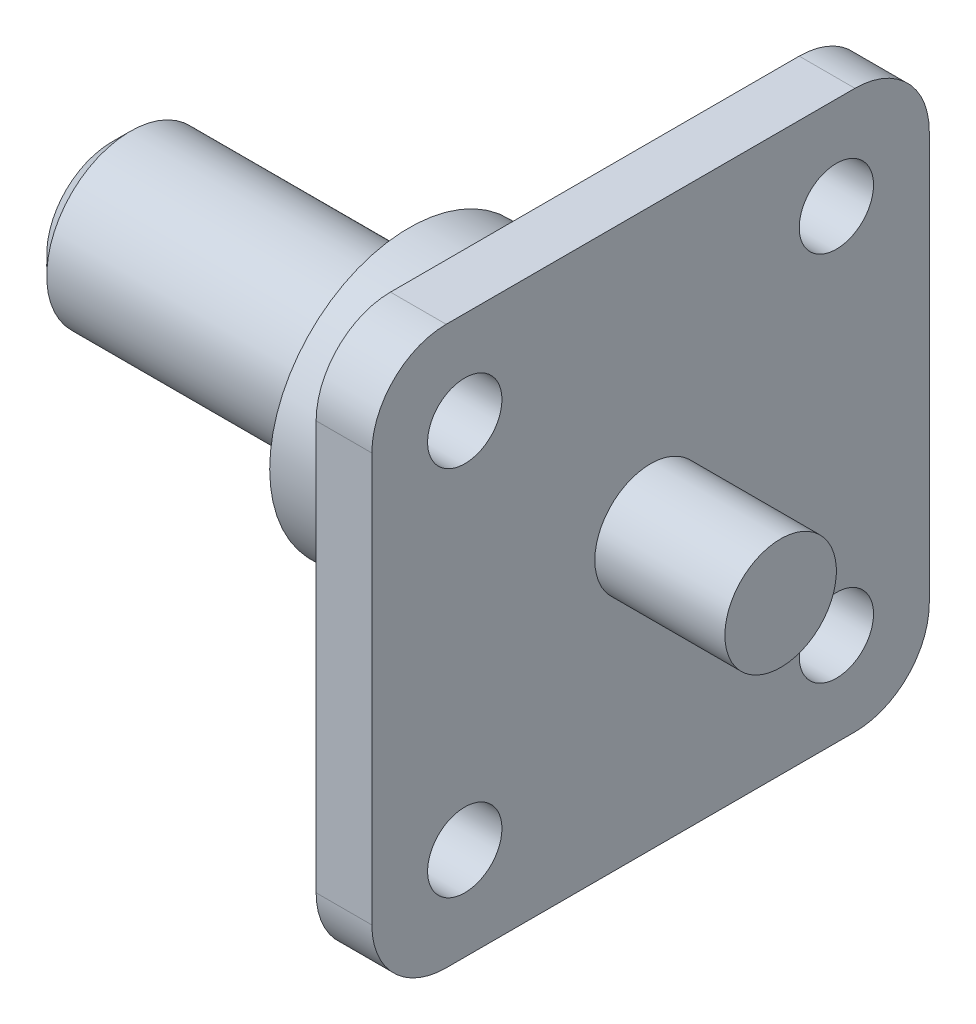
ISO-10303-21;
HEADER;
FILE_DESCRIPTION(('STEP AP214'),'2;1');
FILE_NAME('part.step','',(''),(''),'','','');
FILE_SCHEMA(('AUTOMOTIVE_DESIGN { 1 0 10303 214 1 1 1 1 }'));
ENDSEC;
DATA;
#1=APPLICATION_CONTEXT('core data for automotive mechanical design processes');
#2=APPLICATION_PROTOCOL_DEFINITION('international standard','automotive_design',2000,#1);
#3=PRODUCT_CONTEXT('',#1,'mechanical');
#4=PRODUCT('Part','Part','',(#3));
#5=PRODUCT_RELATED_PRODUCT_CATEGORY('part','',(#4));
#6=PRODUCT_DEFINITION_FORMATION('','',#4);
#7=PRODUCT_DEFINITION_CONTEXT('part definition',#1,'design');
#8=PRODUCT_DEFINITION('design','',#6,#7);
#9=PRODUCT_DEFINITION_SHAPE('','',#8);
#10=(LENGTH_UNIT() NAMED_UNIT(*) SI_UNIT(.MILLI.,.METRE.));
#11=(NAMED_UNIT(*) PLANE_ANGLE_UNIT() SI_UNIT($,.RADIAN.));
#12=(NAMED_UNIT(*) SI_UNIT($,.STERADIAN.) SOLID_ANGLE_UNIT());
#13=UNCERTAINTY_MEASURE_WITH_UNIT(LENGTH_MEASURE(1.E-05),#10,'distance_accuracy_value','');
#14=(GEOMETRIC_REPRESENTATION_CONTEXT(3) GLOBAL_UNCERTAINTY_ASSIGNED_CONTEXT((#13)) GLOBAL_UNIT_ASSIGNED_CONTEXT((#10,
#11,#12)) REPRESENTATION_CONTEXT('',''));
#15=CARTESIAN_POINT('',(0.,0.,0.));
#16=DIRECTION('',(0.,0.,1.));
#17=DIRECTION('',(1.,0.,0.));
#18=AXIS2_PLACEMENT_3D('',#15,#16,#17);
#19=CARTESIAN_POINT('',(-16.,0.,0.));
#20=DIRECTION('',(1.,0.,0.));
#21=DIRECTION('',(0.,0.,-1.));
#22=AXIS2_PLACEMENT_3D('',#19,#20,#21);
#23=PLANE('',#22);
#24=CARTESIAN_POINT('',(-16.,0.,0.));
#25=DIRECTION('',(1.,0.,0.));
#26=DIRECTION('',(0.,0.,-1.));
#27=AXIS2_PLACEMENT_3D('',#24,#25,#26);
#28=CIRCLE('',#27,3.5);
#29=CARTESIAN_POINT('',(-16.,0.,-3.5));
#30=VERTEX_POINT('',#29);
#31=EDGE_CURVE('E176',#30,#30,#28,.F.);
#32=ORIENTED_EDGE('',*,*,#31,.T.);
#33=EDGE_LOOP('',(#32));
#34=FACE_BOUND('',#33,.T.);
#35=ADVANCED_FACE('F32',(#34),#23,.F.);
#36=CARTESIAN_POINT('',(-18.3711340206185,0.,0.));
#37=DIRECTION('',(-1.,0.,0.));
#38=DIRECTION('',(0.,0.,1.));
#39=AXIS2_PLACEMENT_3D('',#36,#37,#38);
#40=CYLINDRICAL_SURFACE('',#39,4.5);
#41=CARTESIAN_POINT('',(-15.,0.,0.));
#42=DIRECTION('',(1.,0.,0.));
#43=DIRECTION('',(0.,0.,-1.));
#44=AXIS2_PLACEMENT_3D('',#41,#42,#43);
#45=CIRCLE('',#44,4.5);
#46=CARTESIAN_POINT('',(-15.,0.,-4.5));
#47=VERTEX_POINT('',#46);
#48=EDGE_CURVE('E41',#47,#47,#45,.T.);
#49=ORIENTED_EDGE('',*,*,#48,.T.);
#50=EDGE_LOOP('',(#49));
#51=FACE_BOUND('',#50,.T.);
#52=CARTESIAN_POINT('',(-1.,0.,0.));
#53=DIRECTION('',(1.,0.,0.));
#54=DIRECTION('',(0.,0.,-1.));
#55=AXIS2_PLACEMENT_3D('',#52,#53,#54);
#56=CIRCLE('',#55,4.5);
#57=CARTESIAN_POINT('',(-1.,0.,-4.5));
#58=VERTEX_POINT('',#57);
#59=EDGE_CURVE('E170',#58,#58,#56,.F.);
#60=ORIENTED_EDGE('',*,*,#59,.T.);
#61=EDGE_LOOP('',(#60));
#62=FACE_BOUND('',#61,.T.);
#63=ADVANCED_FACE('F181',(#51,#62),#40,.T.);
#64=CARTESIAN_POINT('',(0.,4.5,0.));
#65=DIRECTION('',(1.,0.,0.));
#66=DIRECTION('',(0.,0.,-1.));
#67=AXIS2_PLACEMENT_3D('',#64,#65,#66);
#68=PLANE('',#67);
#69=CARTESIAN_POINT('',(0.,0.,0.));
#70=DIRECTION('',(1.,0.,0.));
#71=DIRECTION('',(0.,0.,-1.));
#72=AXIS2_PLACEMENT_3D('',#69,#70,#71);
#73=CIRCLE('',#72,5.5);
#74=CARTESIAN_POINT('',(0.,0.,-5.5));
#75=VERTEX_POINT('',#74);
#76=EDGE_CURVE('E173',#75,#75,#73,.T.);
#77=ORIENTED_EDGE('',*,*,#76,.T.);
#78=EDGE_LOOP('',(#77));
#79=FACE_BOUND('',#78,.T.);
#80=CARTESIAN_POINT('',(0.,0.,0.));
#81=DIRECTION('',(-1.,0.,0.));
#82=DIRECTION('',(0.,0.,1.));
#83=AXIS2_PLACEMENT_3D('',#80,#81,#82);
#84=CIRCLE('',#83,7.5);
#85=CARTESIAN_POINT('',(0.,0.,7.5));
#86=VERTEX_POINT('',#85);
#87=EDGE_CURVE('E167',#86,#86,#84,.T.);
#88=ORIENTED_EDGE('',*,*,#87,.T.);
#89=EDGE_LOOP('',(#88));
#90=FACE_BOUND('',#89,.T.);
#91=ADVANCED_FACE('F194',(#79,#90),#68,.F.);
#92=CARTESIAN_POINT('',(-18.3711340206185,0.,0.));
#93=DIRECTION('',(-1.,0.,0.));
#94=DIRECTION('',(0.,0.,1.));
#95=AXIS2_PLACEMENT_3D('',#92,#93,#94);
#96=CYLINDRICAL_SURFACE('',#95,7.5);
#97=ORIENTED_EDGE('',*,*,#87,.F.);
#98=EDGE_LOOP('',(#97));
#99=FACE_BOUND('',#98,.T.);
#100=CARTESIAN_POINT('',(10.,0.,0.));
#101=DIRECTION('',(-1.,0.,0.));
#102=DIRECTION('',(0.,0.,1.));
#103=AXIS2_PLACEMENT_3D('',#100,#101,#102);
#104=CIRCLE('',#103,7.5);
#105=CARTESIAN_POINT('',(10.,0.,7.5));
#106=VERTEX_POINT('',#105);
#107=EDGE_CURVE('E161',#106,#106,#104,.T.);
#108=ORIENTED_EDGE('',*,*,#107,.T.);
#109=EDGE_LOOP('',(#108));
#110=FACE_BOUND('',#109,.T.);
#111=ADVANCED_FACE('F198',(#99,#110),#96,.T.);
#112=CARTESIAN_POINT('',(-1.,0.,0.));
#113=DIRECTION('',(1.,0.,0.));
#114=DIRECTION('',(0.,0.,-1.));
#115=AXIS2_PLACEMENT_3D('',#112,#113,#114);
#116=TOROIDAL_SURFACE('',#115,5.5,1.);
#117=ORIENTED_EDGE('',*,*,#76,.F.);
#118=EDGE_LOOP('',(#117));
#119=FACE_BOUND('',#118,.T.);
#120=ORIENTED_EDGE('',*,*,#59,.F.);
#121=EDGE_LOOP('',(#120));
#122=FACE_BOUND('',#121,.T.);
#123=ADVANCED_FACE('F186',(#119,#122),#116,.F.);
#124=CARTESIAN_POINT('',(-16.,0.,0.));
#125=DIRECTION('',(1.,0.,0.));
#126=DIRECTION('',(0.,0.,-1.));
#127=AXIS2_PLACEMENT_3D('',#124,#125,#126);
#128=CONICAL_SURFACE('',#127,3.5,0.785398163397446);
#129=ORIENTED_EDGE('',*,*,#48,.F.);
#130=EDGE_LOOP('',(#129));
#131=FACE_BOUND('',#130,.T.);
#132=ORIENTED_EDGE('',*,*,#31,.F.);
#133=EDGE_LOOP('',(#132));
#134=FACE_BOUND('',#133,.T.);
#135=ADVANCED_FACE('F34',(#131,#134),#128,.T.);
#136=CARTESIAN_POINT('',(13.,-11.,11.));
#137=DIRECTION('',(-1.,0.,0.));
#138=DIRECTION('',(0.,0.,1.));
#139=AXIS2_PLACEMENT_3D('',#136,#137,#138);
#140=PLANE('',#139);
#141=CARTESIAN_POINT('',(13.,0.,0.));
#142=DIRECTION('',(-1.,0.,0.));
#143=DIRECTION('',(0.,0.,1.));
#144=AXIS2_PLACEMENT_3D('',#141,#142,#143);
#145=CIRCLE('',#144,3.);
#146=CARTESIAN_POINT('',(13.,0.,3.));
#147=VERTEX_POINT('',#146);
#148=EDGE_CURVE('E11',#147,#147,#145,.T.);
#149=ORIENTED_EDGE('',*,*,#148,.T.);
#150=EDGE_LOOP('',(#149));
#151=FACE_BOUND('',#150,.T.);
#152=CARTESIAN_POINT('',(13.,-11.,11.));
#153=DIRECTION('',(1.,0.,0.));
#154=DIRECTION('',(0.,0.,1.));
#155=AXIS2_PLACEMENT_3D('',#152,#153,#154);
#156=CIRCLE('',#155,4.);
#157=CARTESIAN_POINT('',(13.,-11.,15.));
#158=VERTEX_POINT('',#157);
#159=CARTESIAN_POINT('',(13.,-15.,11.));
#160=VERTEX_POINT('',#159);
#161=EDGE_CURVE('E146',#158,#160,#156,.T.);
#162=ORIENTED_EDGE('',*,*,#161,.T.);
#163=DIRECTION('',(0.,0.,-1.));
#164=VECTOR('',#163,1.);
#165=CARTESIAN_POINT('',(13.,-15.,11.));
#166=LINE('',#165,#164);
#167=CARTESIAN_POINT('',(13.,-15.,-11.));
#168=VERTEX_POINT('',#167);
#169=EDGE_CURVE('E93',#160,#168,#166,.T.);
#170=ORIENTED_EDGE('',*,*,#169,.T.);
#171=CARTESIAN_POINT('',(13.,-11.,-11.));
#172=DIRECTION('',(1.,0.,0.));
#173=DIRECTION('',(0.,0.,-1.));
#174=AXIS2_PLACEMENT_3D('',#171,#172,#173);
#175=CIRCLE('',#174,4.);
#176=CARTESIAN_POINT('',(13.,-11.,-15.));
#177=VERTEX_POINT('',#176);
#178=EDGE_CURVE('E256',#168,#177,#175,.T.);
#179=ORIENTED_EDGE('',*,*,#178,.T.);
#180=DIRECTION('',(0.,1.,0.));
#181=VECTOR('',#180,1.);
#182=CARTESIAN_POINT('',(13.,-11.,-15.));
#183=LINE('',#182,#181);
#184=CARTESIAN_POINT('',(13.,11.,-15.));
#185=VERTEX_POINT('',#184);
#186=EDGE_CURVE('E258',#177,#185,#183,.T.);
#187=ORIENTED_EDGE('',*,*,#186,.T.);
#188=CARTESIAN_POINT('',(13.,11.,-11.));
#189=DIRECTION('',(1.,0.,0.));
#190=DIRECTION('',(0.,0.,1.));
#191=AXIS2_PLACEMENT_3D('',#188,#189,#190);
#192=CIRCLE('',#191,4.);
#193=CARTESIAN_POINT('',(13.,15.,-11.));
#194=VERTEX_POINT('',#193);
#195=EDGE_CURVE('E113',#185,#194,#192,.T.);
#196=ORIENTED_EDGE('',*,*,#195,.T.);
#197=DIRECTION('',(0.,0.,1.));
#198=VECTOR('',#197,1.);
#199=CARTESIAN_POINT('',(13.,15.,11.));
#200=LINE('',#199,#198);
#201=CARTESIAN_POINT('',(13.,15.,11.));
#202=VERTEX_POINT('',#201);
#203=EDGE_CURVE('E106',#194,#202,#200,.T.);
#204=ORIENTED_EDGE('',*,*,#203,.T.);
#205=CARTESIAN_POINT('',(13.,11.,11.));
#206=DIRECTION('',(1.,0.,0.));
#207=DIRECTION('',(0.,0.,1.));
#208=AXIS2_PLACEMENT_3D('',#205,#206,#207);
#209=CIRCLE('',#208,4.);
#210=CARTESIAN_POINT('',(13.,11.,15.));
#211=VERTEX_POINT('',#210);
#212=EDGE_CURVE('E111',#202,#211,#209,.T.);
#213=ORIENTED_EDGE('',*,*,#212,.T.);
#214=DIRECTION('',(0.,-1.,0.));
#215=VECTOR('',#214,1.);
#216=CARTESIAN_POINT('',(13.,-11.,15.));
#217=LINE('',#216,#215);
#218=EDGE_CURVE('E49',#211,#158,#217,.T.);
#219=ORIENTED_EDGE('',*,*,#218,.T.);
#220=EDGE_LOOP('',(#162,#170,#179,#187,#196,#204,#213,#219));
#221=FACE_BOUND('',#220,.T.);
#222=CARTESIAN_POINT('',(13.,10.,10.));
#223=DIRECTION('',(1.,0.,0.));
#224=DIRECTION('',(0.,0.,-1.));
#225=AXIS2_PLACEMENT_3D('',#222,#223,#224);
#226=CIRCLE('',#225,2.);
#227=CARTESIAN_POINT('',(13.,10.,8.));
#228=VERTEX_POINT('',#227);
#229=EDGE_CURVE('E135',#228,#228,#226,.T.);
#230=ORIENTED_EDGE('',*,*,#229,.F.);
#231=EDGE_LOOP('',(#230));
#232=FACE_BOUND('',#231,.T.);
#233=CARTESIAN_POINT('',(13.,10.,-10.));
#234=DIRECTION('',(1.,0.,0.));
#235=DIRECTION('',(0.,0.,-1.));
#236=AXIS2_PLACEMENT_3D('',#233,#234,#235);
#237=CIRCLE('',#236,2.);
#238=CARTESIAN_POINT('',(13.,10.,-12.));
#239=VERTEX_POINT('',#238);
#240=EDGE_CURVE('E247',#239,#239,#237,.T.);
#241=ORIENTED_EDGE('',*,*,#240,.F.);
#242=EDGE_LOOP('',(#241));
#243=FACE_BOUND('',#242,.T.);
#244=CARTESIAN_POINT('',(13.,-10.,-10.));
#245=DIRECTION('',(1.,0.,0.));
#246=DIRECTION('',(0.,0.,-1.));
#247=AXIS2_PLACEMENT_3D('',#244,#245,#246);
#248=CIRCLE('',#247,2.);
#249=CARTESIAN_POINT('',(13.,-10.,-12.));
#250=VERTEX_POINT('',#249);
#251=EDGE_CURVE('E243',#250,#250,#248,.T.);
#252=ORIENTED_EDGE('',*,*,#251,.F.);
#253=EDGE_LOOP('',(#252));
#254=FACE_BOUND('',#253,.T.);
#255=CARTESIAN_POINT('',(13.,-10.,10.));
#256=DIRECTION('',(1.,0.,0.));
#257=DIRECTION('',(0.,0.,-1.));
#258=AXIS2_PLACEMENT_3D('',#255,#256,#257);
#259=CIRCLE('',#258,2.);
#260=CARTESIAN_POINT('',(13.,-10.,8.));
#261=VERTEX_POINT('',#260);
#262=EDGE_CURVE('E238',#261,#261,#259,.T.);
#263=ORIENTED_EDGE('',*,*,#262,.F.);
#264=EDGE_LOOP('',(#263));
#265=FACE_BOUND('',#264,.T.);
#266=ADVANCED_FACE('F108',(#151,#221,#232,#243,#254,#265),#140,.F.);
#267=CARTESIAN_POINT('',(10.,-11.,11.));
#268=DIRECTION('',(-1.,0.,0.));
#269=DIRECTION('',(0.,0.,1.));
#270=AXIS2_PLACEMENT_3D('',#267,#268,#269);
#271=PLANE('',#270);
#272=ORIENTED_EDGE('',*,*,#107,.F.);
#273=EDGE_LOOP('',(#272));
#274=FACE_BOUND('',#273,.T.);
#275=CARTESIAN_POINT('',(10.,-10.,-10.));
#276=DIRECTION('',(1.,0.,0.));
#277=DIRECTION('',(0.,0.,-1.));
#278=AXIS2_PLACEMENT_3D('',#275,#276,#277);
#279=CIRCLE('',#278,2.);
#280=CARTESIAN_POINT('',(10.,-10.,-12.));
#281=VERTEX_POINT('',#280);
#282=EDGE_CURVE('E223',#281,#281,#279,.T.);
#283=ORIENTED_EDGE('',*,*,#282,.T.);
#284=EDGE_LOOP('',(#283));
#285=FACE_BOUND('',#284,.T.);
#286=CARTESIAN_POINT('',(10.,10.,10.));
#287=DIRECTION('',(1.,0.,0.));
#288=DIRECTION('',(0.,0.,-1.));
#289=AXIS2_PLACEMENT_3D('',#286,#287,#288);
#290=CIRCLE('',#289,2.);
#291=CARTESIAN_POINT('',(10.,10.,8.));
#292=VERTEX_POINT('',#291);
#293=EDGE_CURVE('E227',#292,#292,#290,.T.);
#294=ORIENTED_EDGE('',*,*,#293,.T.);
#295=EDGE_LOOP('',(#294));
#296=FACE_BOUND('',#295,.T.);
#297=CARTESIAN_POINT('',(10.,-11.,11.));
#298=DIRECTION('',(1.,0.,0.));
#299=DIRECTION('',(0.,0.,1.));
#300=AXIS2_PLACEMENT_3D('',#297,#298,#299);
#301=CIRCLE('',#300,4.);
#302=CARTESIAN_POINT('',(10.,-11.,15.));
#303=VERTEX_POINT('',#302);
#304=CARTESIAN_POINT('',(10.,-15.,11.));
#305=VERTEX_POINT('',#304);
#306=EDGE_CURVE('E131',#303,#305,#301,.T.);
#307=ORIENTED_EDGE('',*,*,#306,.F.);
#308=DIRECTION('',(0.,-1.,0.));
#309=VECTOR('',#308,1.);
#310=CARTESIAN_POINT('',(10.,-11.,15.));
#311=LINE('',#310,#309);
#312=CARTESIAN_POINT('',(10.,11.,15.));
#313=VERTEX_POINT('',#312);
#314=EDGE_CURVE('E84',#313,#303,#311,.T.);
#315=ORIENTED_EDGE('',*,*,#314,.F.);
#316=CARTESIAN_POINT('',(10.,11.,11.));
#317=DIRECTION('',(1.,0.,0.));
#318=DIRECTION('',(0.,0.,1.));
#319=AXIS2_PLACEMENT_3D('',#316,#317,#318);
#320=CIRCLE('',#319,4.);
#321=CARTESIAN_POINT('',(10.,15.,11.));
#322=VERTEX_POINT('',#321);
#323=EDGE_CURVE('E78',#322,#313,#320,.T.);
#324=ORIENTED_EDGE('',*,*,#323,.F.);
#325=DIRECTION('',(0.,0.,1.));
#326=VECTOR('',#325,1.);
#327=CARTESIAN_POINT('',(10.,15.,11.));
#328=LINE('',#327,#326);
#329=CARTESIAN_POINT('',(10.,15.,-11.));
#330=VERTEX_POINT('',#329);
#331=EDGE_CURVE('E121',#330,#322,#328,.T.);
#332=ORIENTED_EDGE('',*,*,#331,.F.);
#333=CARTESIAN_POINT('',(10.,11.,-11.));
#334=DIRECTION('',(1.,0.,0.));
#335=DIRECTION('',(0.,0.,1.));
#336=AXIS2_PLACEMENT_3D('',#333,#334,#335);
#337=CIRCLE('',#336,4.);
#338=CARTESIAN_POINT('',(10.,11.,-15.));
#339=VERTEX_POINT('',#338);
#340=EDGE_CURVE('E141',#339,#330,#337,.T.);
#341=ORIENTED_EDGE('',*,*,#340,.F.);
#342=DIRECTION('',(0.,1.,0.));
#343=VECTOR('',#342,1.);
#344=CARTESIAN_POINT('',(10.,-11.,-15.));
#345=LINE('',#344,#343);
#346=CARTESIAN_POINT('',(10.,-11.,-15.));
#347=VERTEX_POINT('',#346);
#348=EDGE_CURVE('E139',#347,#339,#345,.T.);
#349=ORIENTED_EDGE('',*,*,#348,.F.);
#350=CARTESIAN_POINT('',(10.,-11.,-11.));
#351=DIRECTION('',(1.,0.,0.));
#352=DIRECTION('',(0.,0.,-1.));
#353=AXIS2_PLACEMENT_3D('',#350,#351,#352);
#354=CIRCLE('',#353,4.);
#355=CARTESIAN_POINT('',(10.,-15.,-11.));
#356=VERTEX_POINT('',#355);
#357=EDGE_CURVE('E137',#356,#347,#354,.T.);
#358=ORIENTED_EDGE('',*,*,#357,.F.);
#359=DIRECTION('',(0.,0.,-1.));
#360=VECTOR('',#359,1.);
#361=CARTESIAN_POINT('',(10.,-15.,11.));
#362=LINE('',#361,#360);
#363=EDGE_CURVE('E134',#305,#356,#362,.T.);
#364=ORIENTED_EDGE('',*,*,#363,.F.);
#365=EDGE_LOOP('',(#307,#315,#324,#332,#341,#349,#358,#364));
#366=FACE_BOUND('',#365,.T.);
#367=CARTESIAN_POINT('',(10.,10.,-10.));
#368=DIRECTION('',(1.,0.,0.));
#369=DIRECTION('',(0.,0.,-1.));
#370=AXIS2_PLACEMENT_3D('',#367,#368,#369);
#371=CIRCLE('',#370,2.);
#372=CARTESIAN_POINT('',(10.,10.,-12.));
#373=VERTEX_POINT('',#372);
#374=EDGE_CURVE('E233',#373,#373,#371,.T.);
#375=ORIENTED_EDGE('',*,*,#374,.T.);
#376=EDGE_LOOP('',(#375));
#377=FACE_BOUND('',#376,.T.);
#378=CARTESIAN_POINT('',(10.,-10.,10.));
#379=DIRECTION('',(1.,0.,0.));
#380=DIRECTION('',(0.,0.,-1.));
#381=AXIS2_PLACEMENT_3D('',#378,#379,#380);
#382=CIRCLE('',#381,2.);
#383=CARTESIAN_POINT('',(10.,-10.,8.));
#384=VERTEX_POINT('',#383);
#385=EDGE_CURVE('E236',#384,#384,#382,.T.);
#386=ORIENTED_EDGE('',*,*,#385,.T.);
#387=EDGE_LOOP('',(#386));
#388=FACE_BOUND('',#387,.T.);
#389=ADVANCED_FACE('F215',(#274,#285,#296,#366,#377,#388),#271,.T.);
#390=CARTESIAN_POINT('',(13.,-11.,11.));
#391=DIRECTION('',(-1.,0.,0.));
#392=DIRECTION('',(0.,0.,1.));
#393=AXIS2_PLACEMENT_3D('',#390,#391,#392);
#394=CYLINDRICAL_SURFACE('',#393,4.);
#395=ORIENTED_EDGE('',*,*,#306,.T.);
#396=DIRECTION('',(-1.,0.,0.));
#397=VECTOR('',#396,1.);
#398=CARTESIAN_POINT('',(13.,-15.,11.));
#399=LINE('',#398,#397);
#400=EDGE_CURVE('E159',#160,#305,#399,.T.);
#401=ORIENTED_EDGE('',*,*,#400,.F.);
#402=ORIENTED_EDGE('',*,*,#161,.F.);
#403=DIRECTION('',(-1.,0.,0.));
#404=VECTOR('',#403,1.);
#405=CARTESIAN_POINT('',(13.,-11.,15.));
#406=LINE('',#405,#404);
#407=EDGE_CURVE('E127',#158,#303,#406,.T.);
#408=ORIENTED_EDGE('',*,*,#407,.T.);
#409=EDGE_LOOP('',(#395,#401,#402,#408));
#410=FACE_BOUND('',#409,.T.);
#411=ADVANCED_FACE('F218',(#410),#394,.T.);
#412=CARTESIAN_POINT('',(13.,-15.,11.));
#413=DIRECTION('',(0.,1.,0.));
#414=DIRECTION('',(0.,0.,1.));
#415=AXIS2_PLACEMENT_3D('',#412,#413,#414);
#416=PLANE('',#415);
#417=ORIENTED_EDGE('',*,*,#363,.T.);
#418=DIRECTION('',(-1.,0.,0.));
#419=VECTOR('',#418,1.);
#420=CARTESIAN_POINT('',(13.,-15.,-11.));
#421=LINE('',#420,#419);
#422=EDGE_CURVE('E156',#168,#356,#421,.T.);
#423=ORIENTED_EDGE('',*,*,#422,.F.);
#424=ORIENTED_EDGE('',*,*,#169,.F.);
#425=ORIENTED_EDGE('',*,*,#400,.T.);
#426=EDGE_LOOP('',(#417,#423,#424,#425));
#427=FACE_BOUND('',#426,.T.);
#428=ADVANCED_FACE('F272',(#427),#416,.F.);
#429=CARTESIAN_POINT('',(13.,-11.,-11.));
#430=DIRECTION('',(-1.,0.,0.));
#431=DIRECTION('',(0.,0.,1.));
#432=AXIS2_PLACEMENT_3D('',#429,#430,#431);
#433=CYLINDRICAL_SURFACE('',#432,4.);
#434=ORIENTED_EDGE('',*,*,#357,.T.);
#435=DIRECTION('',(-1.,0.,0.));
#436=VECTOR('',#435,1.);
#437=CARTESIAN_POINT('',(13.,-11.,-15.));
#438=LINE('',#437,#436);
#439=EDGE_CURVE('E153',#177,#347,#438,.T.);
#440=ORIENTED_EDGE('',*,*,#439,.F.);
#441=ORIENTED_EDGE('',*,*,#178,.F.);
#442=ORIENTED_EDGE('',*,*,#422,.T.);
#443=EDGE_LOOP('',(#434,#440,#441,#442));
#444=FACE_BOUND('',#443,.T.);
#445=ADVANCED_FACE('F271',(#444),#433,.T.);
#446=CARTESIAN_POINT('',(13.,-11.,-15.));
#447=DIRECTION('',(0.,0.,1.));
#448=DIRECTION('',(1.,0.,0.));
#449=AXIS2_PLACEMENT_3D('',#446,#447,#448);
#450=PLANE('',#449);
#451=ORIENTED_EDGE('',*,*,#348,.T.);
#452=DIRECTION('',(-1.,0.,0.));
#453=VECTOR('',#452,1.);
#454=CARTESIAN_POINT('',(13.,11.,-15.));
#455=LINE('',#454,#453);
#456=EDGE_CURVE('E150',#185,#339,#455,.T.);
#457=ORIENTED_EDGE('',*,*,#456,.F.);
#458=ORIENTED_EDGE('',*,*,#186,.F.);
#459=ORIENTED_EDGE('',*,*,#439,.T.);
#460=EDGE_LOOP('',(#451,#457,#458,#459));
#461=FACE_BOUND('',#460,.T.);
#462=ADVANCED_FACE('F264',(#461),#450,.F.);
#463=CARTESIAN_POINT('',(13.,11.,-11.));
#464=DIRECTION('',(-1.,0.,0.));
#465=DIRECTION('',(0.,0.,1.));
#466=AXIS2_PLACEMENT_3D('',#463,#464,#465);
#467=CYLINDRICAL_SURFACE('',#466,4.);
#468=ORIENTED_EDGE('',*,*,#340,.T.);
#469=DIRECTION('',(-1.,0.,0.));
#470=VECTOR('',#469,1.);
#471=CARTESIAN_POINT('',(13.,15.,-11.));
#472=LINE('',#471,#470);
#473=EDGE_CURVE('E122',#194,#330,#472,.T.);
#474=ORIENTED_EDGE('',*,*,#473,.F.);
#475=ORIENTED_EDGE('',*,*,#195,.F.);
#476=ORIENTED_EDGE('',*,*,#456,.T.);
#477=EDGE_LOOP('',(#468,#474,#475,#476));
#478=FACE_BOUND('',#477,.T.);
#479=ADVANCED_FACE('F268',(#478),#467,.T.);
#480=CARTESIAN_POINT('',(13.,15.,11.));
#481=DIRECTION('',(0.,-1.,0.));
#482=DIRECTION('',(0.,0.,-1.));
#483=AXIS2_PLACEMENT_3D('',#480,#481,#482);
#484=PLANE('',#483);
#485=ORIENTED_EDGE('',*,*,#331,.T.);
#486=DIRECTION('',(-1.,0.,0.));
#487=VECTOR('',#486,1.);
#488=CARTESIAN_POINT('',(13.,15.,11.));
#489=LINE('',#488,#487);
#490=EDGE_CURVE('E118',#202,#322,#489,.T.);
#491=ORIENTED_EDGE('',*,*,#490,.F.);
#492=ORIENTED_EDGE('',*,*,#203,.F.);
#493=ORIENTED_EDGE('',*,*,#473,.T.);
#494=EDGE_LOOP('',(#485,#491,#492,#493));
#495=FACE_BOUND('',#494,.T.);
#496=ADVANCED_FACE('F119',(#495),#484,.F.);
#497=CARTESIAN_POINT('',(13.,11.,11.));
#498=DIRECTION('',(-1.,0.,0.));
#499=DIRECTION('',(0.,0.,1.));
#500=AXIS2_PLACEMENT_3D('',#497,#498,#499);
#501=CYLINDRICAL_SURFACE('',#500,4.);
#502=ORIENTED_EDGE('',*,*,#323,.T.);
#503=DIRECTION('',(-1.,0.,0.));
#504=VECTOR('',#503,1.);
#505=CARTESIAN_POINT('',(13.,11.,15.));
#506=LINE('',#505,#504);
#507=EDGE_CURVE('E123',#211,#313,#506,.T.);
#508=ORIENTED_EDGE('',*,*,#507,.F.);
#509=ORIENTED_EDGE('',*,*,#212,.F.);
#510=ORIENTED_EDGE('',*,*,#490,.T.);
#511=EDGE_LOOP('',(#502,#508,#509,#510));
#512=FACE_BOUND('',#511,.T.);
#513=ADVANCED_FACE('F125',(#512),#501,.T.);
#514=CARTESIAN_POINT('',(13.,-11.,15.));
#515=DIRECTION('',(0.,0.,-1.));
#516=DIRECTION('',(-1.,0.,0.));
#517=AXIS2_PLACEMENT_3D('',#514,#515,#516);
#518=PLANE('',#517);
#519=ORIENTED_EDGE('',*,*,#314,.T.);
#520=ORIENTED_EDGE('',*,*,#407,.F.);
#521=ORIENTED_EDGE('',*,*,#218,.F.);
#522=ORIENTED_EDGE('',*,*,#507,.T.);
#523=EDGE_LOOP('',(#519,#520,#521,#522));
#524=FACE_BOUND('',#523,.T.);
#525=ADVANCED_FACE('F276',(#524),#518,.F.);
#526=CARTESIAN_POINT('',(13.,10.,10.));
#527=DIRECTION('',(-1.,0.,0.));
#528=DIRECTION('',(0.,0.,1.));
#529=AXIS2_PLACEMENT_3D('',#526,#527,#528);
#530=CYLINDRICAL_SURFACE('',#529,2.);
#531=ORIENTED_EDGE('',*,*,#229,.T.);
#532=EDGE_LOOP('',(#531));
#533=FACE_BOUND('',#532,.T.);
#534=ORIENTED_EDGE('',*,*,#293,.F.);
#535=EDGE_LOOP('',(#534));
#536=FACE_BOUND('',#535,.T.);
#537=ADVANCED_FACE('F278',(#533,#536),#530,.F.);
#538=CARTESIAN_POINT('',(13.,10.,-10.));
#539=DIRECTION('',(-1.,0.,0.));
#540=DIRECTION('',(0.,0.,1.));
#541=AXIS2_PLACEMENT_3D('',#538,#539,#540);
#542=CYLINDRICAL_SURFACE('',#541,2.);
#543=ORIENTED_EDGE('',*,*,#240,.T.);
#544=EDGE_LOOP('',(#543));
#545=FACE_BOUND('',#544,.T.);
#546=ORIENTED_EDGE('',*,*,#374,.F.);
#547=EDGE_LOOP('',(#546));
#548=FACE_BOUND('',#547,.T.);
#549=ADVANCED_FACE('F284',(#545,#548),#542,.F.);
#550=CARTESIAN_POINT('',(13.,-10.,-10.));
#551=DIRECTION('',(-1.,0.,0.));
#552=DIRECTION('',(0.,0.,1.));
#553=AXIS2_PLACEMENT_3D('',#550,#551,#552);
#554=CYLINDRICAL_SURFACE('',#553,2.);
#555=ORIENTED_EDGE('',*,*,#251,.T.);
#556=EDGE_LOOP('',(#555));
#557=FACE_BOUND('',#556,.T.);
#558=ORIENTED_EDGE('',*,*,#282,.F.);
#559=EDGE_LOOP('',(#558));
#560=FACE_BOUND('',#559,.T.);
#561=ADVANCED_FACE('F322',(#557,#560),#554,.F.);
#562=CARTESIAN_POINT('',(13.,-10.,10.));
#563=DIRECTION('',(-1.,0.,0.));
#564=DIRECTION('',(0.,0.,1.));
#565=AXIS2_PLACEMENT_3D('',#562,#563,#564);
#566=CYLINDRICAL_SURFACE('',#565,2.);
#567=ORIENTED_EDGE('',*,*,#262,.T.);
#568=EDGE_LOOP('',(#567));
#569=FACE_BOUND('',#568,.T.);
#570=ORIENTED_EDGE('',*,*,#385,.F.);
#571=EDGE_LOOP('',(#570));
#572=FACE_BOUND('',#571,.T.);
#573=ADVANCED_FACE('F306',(#569,#572),#566,.F.);
#574=CARTESIAN_POINT('',(20.,3.,0.));
#575=DIRECTION('',(-1.,0.,0.));
#576=DIRECTION('',(0.,0.,1.));
#577=AXIS2_PLACEMENT_3D('',#574,#575,#576);
#578=PLANE('',#577);
#579=CARTESIAN_POINT('',(20.,0.,0.));
#580=DIRECTION('',(-1.,0.,0.));
#581=DIRECTION('',(0.,0.,1.));
#582=AXIS2_PLACEMENT_3D('',#579,#580,#581);
#583=CIRCLE('',#582,3.);
#584=CARTESIAN_POINT('',(20.,0.,3.));
#585=VERTEX_POINT('',#584);
#586=EDGE_CURVE('E164',#585,#585,#583,.T.);
#587=ORIENTED_EDGE('',*,*,#586,.F.);
#588=EDGE_LOOP('',(#587));
#589=FACE_BOUND('',#588,.T.);
#590=ADVANCED_FACE('F302',(#589),#578,.F.);
#591=CARTESIAN_POINT('',(-18.3711340206185,0.,0.));
#592=DIRECTION('',(-1.,0.,0.));
#593=DIRECTION('',(0.,0.,1.));
#594=AXIS2_PLACEMENT_3D('',#591,#592,#593);
#595=CYLINDRICAL_SURFACE('',#594,3.);
#596=ORIENTED_EDGE('',*,*,#586,.T.);
#597=EDGE_LOOP('',(#596));
#598=FACE_BOUND('',#597,.T.);
#599=ORIENTED_EDGE('',*,*,#148,.F.);
#600=EDGE_LOOP('',(#599));
#601=FACE_BOUND('',#600,.T.);
#602=ADVANCED_FACE('F305',(#598,#601),#595,.T.);
#603=CLOSED_SHELL('',(#35,#63,#91,#111,#123,#135,#266,#389,#411,#428,#445,#462,#479,#496,#513,
#525,#537,#549,#561,#573,#590,#602));
#604=MANIFOLD_SOLID_BREP('B2',#603);
#605=ADVANCED_BREP_SHAPE_REPRESENTATION('',(#18,#604),#14);
#606=SHAPE_DEFINITION_REPRESENTATION(#9,#605);
ENDSEC;
END-ISO-10303-21;
